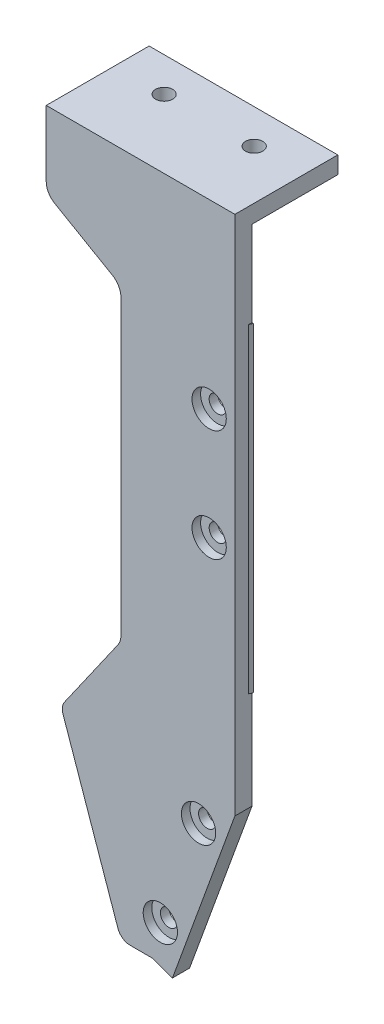
ISO-10303-21;
HEADER;
FILE_DESCRIPTION(('STEP AP214'),'2;1');
FILE_NAME('part.step','',(''),(''),'','','');
FILE_SCHEMA(('AUTOMOTIVE_DESIGN { 1 0 10303 214 1 1 1 1 }'));
ENDSEC;
DATA;
#1=APPLICATION_CONTEXT('core data for automotive mechanical design processes');
#2=APPLICATION_PROTOCOL_DEFINITION('international standard','automotive_design',2000,#1);
#3=PRODUCT_CONTEXT('',#1,'mechanical');
#4=PRODUCT('Part','Part','',(#3));
#5=PRODUCT_RELATED_PRODUCT_CATEGORY('part','',(#4));
#6=PRODUCT_DEFINITION_FORMATION('','',#4);
#7=PRODUCT_DEFINITION_CONTEXT('part definition',#1,'design');
#8=PRODUCT_DEFINITION('design','',#6,#7);
#9=PRODUCT_DEFINITION_SHAPE('','',#8);
#10=(LENGTH_UNIT() NAMED_UNIT(*) SI_UNIT(.MILLI.,.METRE.));
#11=(NAMED_UNIT(*) PLANE_ANGLE_UNIT() SI_UNIT($,.RADIAN.));
#12=(NAMED_UNIT(*) SI_UNIT($,.STERADIAN.) SOLID_ANGLE_UNIT());
#13=UNCERTAINTY_MEASURE_WITH_UNIT(LENGTH_MEASURE(1.E-05),#10,'distance_accuracy_value','');
#14=(GEOMETRIC_REPRESENTATION_CONTEXT(3) GLOBAL_UNCERTAINTY_ASSIGNED_CONTEXT((#13)) GLOBAL_UNIT_ASSIGNED_CONTEXT((#10,
#11,#12)) REPRESENTATION_CONTEXT('',''));
#15=CARTESIAN_POINT('',(0.,0.,0.));
#16=DIRECTION('',(0.,0.,1.));
#17=DIRECTION('',(1.,0.,0.));
#18=AXIS2_PLACEMENT_3D('',#15,#16,#17);
#19=CARTESIAN_POINT('',(91.0567161561715,-93.9915403547906,27.5));
#20=DIRECTION('',(0.,0.,-1.));
#21=DIRECTION('',(-1.,0.,0.));
#22=AXIS2_PLACEMENT_3D('',#19,#20,#21);
#23=CYLINDRICAL_SURFACE('',#22,0.999999999999998);
#24=CARTESIAN_POINT('',(91.0567161561715,-93.9915403547906,21.5));
#25=DIRECTION('',(0.,0.,-1.));
#26=DIRECTION('',(-1.,0.,0.));
#27=AXIS2_PLACEMENT_3D('',#24,#25,#26);
#28=CIRCLE('',#27,0.999999999999998);
#29=CARTESIAN_POINT('',(90.0567161561715,-93.9915403547906,21.5));
#30=VERTEX_POINT('',#29);
#31=EDGE_CURVE('E342',#30,#30,#28,.T.);
#32=ORIENTED_EDGE('',*,*,#31,.T.);
#33=EDGE_LOOP('',(#32));
#34=FACE_BOUND('',#33,.T.);
#35=CARTESIAN_POINT('',(91.0567161561715,-93.9915403547906,22.5));
#36=DIRECTION('',(0.,0.,1.));
#37=DIRECTION('',(1.,0.,0.));
#38=AXIS2_PLACEMENT_3D('',#35,#36,#37);
#39=CIRCLE('',#38,0.999999999999998);
#40=CARTESIAN_POINT('',(92.0567161561715,-93.9915403547906,22.5));
#41=VERTEX_POINT('',#40);
#42=EDGE_CURVE('E42',#41,#41,#39,.F.);
#43=ORIENTED_EDGE('',*,*,#42,.F.);
#44=EDGE_LOOP('',(#43));
#45=FACE_BOUND('',#44,.T.);
#46=ADVANCED_FACE('F38',(#34,#45),#23,.F.);
#47=CARTESIAN_POINT('',(86.6001936886376,-106.235735203631,27.5));
#48=DIRECTION('',(0.,0.,-1.));
#49=DIRECTION('',(-1.,0.,0.));
#50=AXIS2_PLACEMENT_3D('',#47,#48,#49);
#51=CYLINDRICAL_SURFACE('',#50,0.999999999999998);
#52=CARTESIAN_POINT('',(86.6001936886376,-106.235735203631,21.5));
#53=DIRECTION('',(0.,0.,-1.));
#54=DIRECTION('',(-1.,0.,0.));
#55=AXIS2_PLACEMENT_3D('',#52,#53,#54);
#56=CIRCLE('',#55,0.999999999999998);
#57=CARTESIAN_POINT('',(85.6001936886376,-106.235735203631,21.5));
#58=VERTEX_POINT('',#57);
#59=EDGE_CURVE('E367',#58,#58,#56,.T.);
#60=ORIENTED_EDGE('',*,*,#59,.T.);
#61=EDGE_LOOP('',(#60));
#62=FACE_BOUND('',#61,.T.);
#63=CARTESIAN_POINT('',(86.6001936886376,-106.235735203631,22.5));
#64=DIRECTION('',(0.,0.,1.));
#65=DIRECTION('',(1.,0.,0.));
#66=AXIS2_PLACEMENT_3D('',#63,#64,#65);
#67=CIRCLE('',#66,0.999999999999998);
#68=CARTESIAN_POINT('',(87.6001936886376,-106.235735203631,22.5));
#69=VERTEX_POINT('',#68);
#70=EDGE_CURVE('E346',#69,#69,#67,.F.);
#71=ORIENTED_EDGE('',*,*,#70,.F.);
#72=EDGE_LOOP('',(#71));
#73=FACE_BOUND('',#72,.T.);
#74=ADVANCED_FACE('F428',(#62,#73),#51,.F.);
#75=CARTESIAN_POINT('',(92.2895532458189,-64.5135083268963,27.5));
#76=DIRECTION('',(0.,0.,-1.));
#77=DIRECTION('',(-1.,0.,0.));
#78=AXIS2_PLACEMENT_3D('',#75,#76,#77);
#79=CYLINDRICAL_SURFACE('',#78,0.999999999999998);
#80=CARTESIAN_POINT('',(92.2895532458189,-64.5135083268963,21.5));
#81=DIRECTION('',(0.,0.,-1.));
#82=DIRECTION('',(-1.,0.,0.));
#83=AXIS2_PLACEMENT_3D('',#80,#81,#82);
#84=CIRCLE('',#83,0.999999999999998);
#85=CARTESIAN_POINT('',(91.2895532458189,-64.5135083268963,21.5));
#86=VERTEX_POINT('',#85);
#87=EDGE_CURVE('E363',#86,#86,#84,.T.);
#88=ORIENTED_EDGE('',*,*,#87,.T.);
#89=EDGE_LOOP('',(#88));
#90=FACE_BOUND('',#89,.T.);
#91=CARTESIAN_POINT('',(92.2895532458189,-64.5135083268963,22.5));
#92=DIRECTION('',(0.,0.,1.));
#93=DIRECTION('',(1.,0.,0.));
#94=AXIS2_PLACEMENT_3D('',#91,#92,#93);
#95=CIRCLE('',#94,0.999999999999998);
#96=CARTESIAN_POINT('',(93.2895532458189,-64.5135083268963,22.5));
#97=VERTEX_POINT('',#96);
#98=EDGE_CURVE('E344',#97,#97,#95,.F.);
#99=ORIENTED_EDGE('',*,*,#98,.F.);
#100=EDGE_LOOP('',(#99));
#101=FACE_BOUND('',#100,.T.);
#102=ADVANCED_FACE('F434',(#90,#101),#79,.F.);
#103=CARTESIAN_POINT('',(92.2895532458189,-51.5135083268963,27.5));
#104=DIRECTION('',(0.,0.,-1.));
#105=DIRECTION('',(-1.,0.,0.));
#106=AXIS2_PLACEMENT_3D('',#103,#104,#105);
#107=CYLINDRICAL_SURFACE('',#106,0.999999999999998);
#108=CARTESIAN_POINT('',(92.2895532458189,-51.5135083268963,21.5));
#109=DIRECTION('',(0.,0.,-1.));
#110=DIRECTION('',(-1.,0.,0.));
#111=AXIS2_PLACEMENT_3D('',#108,#109,#110);
#112=CIRCLE('',#111,0.999999999999998);
#113=CARTESIAN_POINT('',(91.2895532458189,-51.5135083268963,21.5));
#114=VERTEX_POINT('',#113);
#115=EDGE_CURVE('E366',#114,#114,#112,.T.);
#116=ORIENTED_EDGE('',*,*,#115,.T.);
#117=EDGE_LOOP('',(#116));
#118=FACE_BOUND('',#117,.T.);
#119=CARTESIAN_POINT('',(92.2895532458189,-51.5135083268963,22.5));
#120=DIRECTION('',(0.,0.,1.));
#121=DIRECTION('',(1.,0.,0.));
#122=AXIS2_PLACEMENT_3D('',#119,#120,#121);
#123=CIRCLE('',#122,0.999999999999998);
#124=CARTESIAN_POINT('',(93.2895532458189,-51.5135083268963,22.5));
#125=VERTEX_POINT('',#124);
#126=EDGE_CURVE('E339',#125,#125,#123,.F.);
#127=ORIENTED_EDGE('',*,*,#126,.F.);
#128=EDGE_LOOP('',(#127));
#129=FACE_BOUND('',#128,.T.);
#130=ADVANCED_FACE('F440',(#118,#129),#107,.F.);
#131=CARTESIAN_POINT('',(70.,-110.3,21.5));
#132=DIRECTION('',(0.,0.,1.));
#133=DIRECTION('',(0.,-1.,0.));
#134=AXIS2_PLACEMENT_3D('',#131,#132,#133);
#135=PLANE('',#134);
#136=ORIENTED_EDGE('',*,*,#87,.F.);
#137=EDGE_LOOP('',(#136));
#138=FACE_BOUND('',#137,.T.);
#139=ORIENTED_EDGE('',*,*,#59,.F.);
#140=EDGE_LOOP('',(#139));
#141=FACE_BOUND('',#140,.T.);
#142=ORIENTED_EDGE('',*,*,#31,.F.);
#143=EDGE_LOOP('',(#142));
#144=FACE_BOUND('',#143,.T.);
#145=ORIENTED_EDGE('',*,*,#115,.F.);
#146=EDGE_LOOP('',(#145));
#147=FACE_BOUND('',#146,.T.);
#148=DIRECTION('',(-1.,0.,0.));
#149=VECTOR('',#148,1.);
#150=CARTESIAN_POINT('',(73.2895532458189,-32.3635083268963,21.5));
#151=LINE('',#150,#149);
#152=CARTESIAN_POINT('',(95.2895532458189,-32.3635083268963,21.5));
#153=VERTEX_POINT('',#152);
#154=CARTESIAN_POINT('',(73.2895532458189,-32.3635083268963,21.5));
#155=VERTEX_POINT('',#154);
#156=EDGE_CURVE('E55',#153,#155,#151,.T.);
#157=ORIENTED_EDGE('',*,*,#156,.F.);
#158=DIRECTION('',(0.,1.,0.));
#159=VECTOR('',#158,1.);
#160=CARTESIAN_POINT('',(95.2895532458189,0.,21.5));
#161=LINE('',#160,#159);
#162=CARTESIAN_POINT('',(95.2895532458189,-42.3,21.5));
#163=VERTEX_POINT('',#162);
#164=EDGE_CURVE('E198',#163,#153,#161,.T.);
#165=ORIENTED_EDGE('',*,*,#164,.F.);
#166=DIRECTION('',(1.,0.,0.));
#167=VECTOR('',#166,1.);
#168=CARTESIAN_POINT('',(94.75,-42.3,21.5));
#169=LINE('',#168,#167);
#170=CARTESIAN_POINT('',(95.4364916731037,-42.3,21.5));
#171=VERTEX_POINT('',#170);
#172=EDGE_CURVE('E265',#163,#171,#169,.T.);
#173=ORIENTED_EDGE('',*,*,#172,.T.);
#174=DIRECTION('',(0.,-1.,0.));
#175=VECTOR('',#174,1.);
#176=CARTESIAN_POINT('',(95.4364916731037,-42.3,21.5));
#177=LINE('',#176,#175);
#178=CARTESIAN_POINT('',(95.4364916731037,-79.5997924618132,21.5));
#179=VERTEX_POINT('',#178);
#180=EDGE_CURVE('E267',#171,#179,#177,.T.);
#181=ORIENTED_EDGE('',*,*,#180,.T.);
#182=DIRECTION('',(1.,0.,0.));
#183=VECTOR('',#182,1.);
#184=CARTESIAN_POINT('',(94.38388347648,-79.59979246179,21.5));
#185=LINE('',#184,#183);
#186=CARTESIAN_POINT('',(95.2895532458189,-79.5997924618016,21.5));
#187=VERTEX_POINT('',#186);
#188=EDGE_CURVE('E270',#187,#179,#185,.T.);
#189=ORIENTED_EDGE('',*,*,#188,.F.);
#190=CARTESIAN_POINT('',(95.2895532458189,-91.1333292312439,21.5));
#191=VERTEX_POINT('',#190);
#192=EDGE_CURVE('E211',#191,#187,#161,.T.);
#193=ORIENTED_EDGE('',*,*,#192,.F.);
#194=DIRECTION('',(-0.342020143325699,-0.939692620785897,0.));
#195=VECTOR('',#194,1.);
#196=CARTESIAN_POINT('',(95.2895532458189,-91.1333292312439,21.5));
#197=LINE('',#196,#195);
#198=CARTESIAN_POINT('',(88.0101485604946,-111.133329231243,21.5));
#199=VERTEX_POINT('',#198);
#200=EDGE_CURVE('E262',#191,#199,#197,.T.);
#201=ORIENTED_EDGE('',*,*,#200,.T.);
#202=DIRECTION('',(-0.939692620785897,0.342020143325699,0.));
#203=VECTOR('',#202,1.);
#204=CARTESIAN_POINT('',(86.190441625069,-110.47101007166,21.5));
#205=LINE('',#204,#203);
#206=CARTESIAN_POINT('',(85.720595314676,-110.3,21.5));
#207=VERTEX_POINT('',#206);
#208=EDGE_CURVE('E273',#199,#207,#205,.T.);
#209=ORIENTED_EDGE('',*,*,#208,.T.);
#210=DIRECTION('',(1.,0.,0.));
#211=VECTOR('',#210,1.);
#212=CARTESIAN_POINT('',(83.066681965713,-110.3,21.5));
#213=LINE('',#212,#211);
#214=CARTESIAN_POINT('',(83.066681965713,-110.3,21.5));
#215=VERTEX_POINT('',#214);
#216=EDGE_CURVE('E278',#215,#207,#213,.T.);
#217=ORIENTED_EDGE('',*,*,#216,.F.);
#218=CARTESIAN_POINT('',(83.066681965713,-108.8,21.5));
#219=DIRECTION('',(0.,0.,-1.));
#220=DIRECTION('',(0.,-1.,0.));
#221=AXIS2_PLACEMENT_3D('',#218,#219,#220);
#222=CIRCLE('',#221,1.5);
#223=CARTESIAN_POINT('',(81.6498173079181,-109.29243734778,21.5));
#224=VERTEX_POINT('',#223);
#225=EDGE_CURVE('E277',#215,#224,#222,.T.);
#226=ORIENTED_EDGE('',*,*,#225,.T.);
#227=DIRECTION('',(-0.328291565188003,0.944576438530208,0.));
#228=VECTOR('',#227,1.);
#229=CARTESIAN_POINT('',(81.6498173079181,-109.29243734778,21.5));
#230=LINE('',#229,#228);
#231=CARTESIAN_POINT('',(75.251803773117,-90.88376201398,21.5));
#232=VERTEX_POINT('',#231);
#233=EDGE_CURVE('E283',#224,#232,#230,.T.);
#234=ORIENTED_EDGE('',*,*,#233,.T.);
#235=CARTESIAN_POINT('',(76.668668430912,-90.3913246662,21.5));
#236=DIRECTION('',(0.,0.,-1.));
#237=DIRECTION('',(-0.944576438530206,-0.328291565188007,0.));
#238=AXIS2_PLACEMENT_3D('',#235,#236,#237);
#239=CIRCLE('',#238,1.5);
#240=CARTESIAN_POINT('',(75.439940364479,-89.5309600116699,21.5));
#241=VERTEX_POINT('',#240);
#242=EDGE_CURVE('E286',#232,#241,#239,.T.);
#243=ORIENTED_EDGE('',*,*,#242,.T.);
#244=DIRECTION('',(0.573576436351011,0.819152044289016,0.));
#245=VECTOR('',#244,1.);
#246=CARTESIAN_POINT('',(75.439940364479,-89.5309600116699,21.5));
#247=LINE('',#246,#245);
#248=CARTESIAN_POINT('',(81.638304088578,-80.67877921404,21.5));
#249=VERTEX_POINT('',#248);
#250=EDGE_CURVE('E289',#241,#249,#247,.T.);
#251=ORIENTED_EDGE('',*,*,#250,.T.);
#252=CARTESIAN_POINT('',(80.,-79.5316263413399,21.5));
#253=DIRECTION('',(0.,0.,1.));
#254=DIRECTION('',(0.81915204428897,-0.573576436351077,0.));
#255=AXIS2_PLACEMENT_3D('',#252,#253,#254);
#256=CIRCLE('',#255,2.);
#257=CARTESIAN_POINT('',(82.,-79.5316263413399,21.5));
#258=VERTEX_POINT('',#257);
#259=EDGE_CURVE('E292',#249,#258,#256,.T.);
#260=ORIENTED_EDGE('',*,*,#259,.T.);
#261=DIRECTION('',(0.,1.,0.));
#262=VECTOR('',#261,1.);
#263=CARTESIAN_POINT('',(82.,-79.5316263413399,21.5));
#264=LINE('',#263,#262);
#265=CARTESIAN_POINT('',(82.,-45.38290376865,21.5));
#266=VERTEX_POINT('',#265);
#267=EDGE_CURVE('E295',#258,#266,#264,.T.);
#268=ORIENTED_EDGE('',*,*,#267,.T.);
#269=CARTESIAN_POINT('',(80.,-45.38290376865,21.5));
#270=DIRECTION('',(0.,0.,1.));
#271=DIRECTION('',(1.,0.,0.));
#272=AXIS2_PLACEMENT_3D('',#269,#270,#271);
#273=CIRCLE('',#272,2.);
#274=CARTESIAN_POINT('',(81.,-43.65085296109,21.5));
#275=VERTEX_POINT('',#274);
#276=EDGE_CURVE('E298',#266,#275,#273,.T.);
#277=ORIENTED_EDGE('',*,*,#276,.T.);
#278=DIRECTION('',(-0.866025403784429,0.500000000000017,0.));
#279=VECTOR('',#278,1.);
#280=CARTESIAN_POINT('',(81.,-43.65085296109,21.5));
#281=LINE('',#280,#279);
#282=CARTESIAN_POINT('',(74.2895532458181,-39.7765747211803,21.5));
#283=VERTEX_POINT('',#282);
#284=EDGE_CURVE('E301',#275,#283,#281,.T.);
#285=ORIENTED_EDGE('',*,*,#284,.T.);
#286=CARTESIAN_POINT('',(75.2895532458189,-38.0445239136101,21.5));
#287=DIRECTION('',(0.,0.,1.));
#288=DIRECTION('',(1.,0.,0.));
#289=AXIS2_PLACEMENT_3D('',#286,#287,#288);
#290=CIRCLE('',#289,2.);
#291=CARTESIAN_POINT('',(73.2895532458189,-38.0445239136101,21.5));
#292=VERTEX_POINT('',#291);
#293=EDGE_CURVE('E335',#283,#292,#290,.F.);
#294=ORIENTED_EDGE('',*,*,#293,.T.);
#295=DIRECTION('',(0.,-1.,0.));
#296=VECTOR('',#295,1.);
#297=CARTESIAN_POINT('',(73.2895532458189,0.,21.5));
#298=LINE('',#297,#296);
#299=EDGE_CURVE('E199',#155,#292,#298,.T.);
#300=ORIENTED_EDGE('',*,*,#299,.F.);
#301=EDGE_LOOP('',(#157,#165,#173,#181,#189,#193,#201,#209,#217,#226,#234,#243,#251,#260,#268,
#277,#285,#294,#300));
#302=FACE_BOUND('',#301,.T.);
#303=ADVANCED_FACE('F403',(#138,#141,#144,#147,#302),#135,.F.);
#304=CARTESIAN_POINT('',(93.5,-42.3,21.));
#305=DIRECTION('',(0.,-1.,0.));
#306=DIRECTION('',(-1.,0.,0.));
#307=AXIS2_PLACEMENT_3D('',#304,#305,#306);
#308=CYLINDRICAL_SURFACE('',#307,2.);
#309=CARTESIAN_POINT('',(93.5,-42.3,21.));
#310=DIRECTION('',(0.,-1.,0.));
#311=DIRECTION('',(1.,0.,0.));
#312=AXIS2_PLACEMENT_3D('',#309,#310,#311);
#313=CIRCLE('',#312,2.);
#314=CARTESIAN_POINT('',(95.2895532458189,-42.3,21.8930280960748));
#315=VERTEX_POINT('',#314);
#316=EDGE_CURVE('E325',#171,#315,#313,.T.);
#317=ORIENTED_EDGE('',*,*,#316,.T.);
#318=DIRECTION('',(0.,-1.,0.));
#319=VECTOR('',#318,1.);
#320=CARTESIAN_POINT('',(95.2895532458189,-42.3,21.8930280960748));
#321=LINE('',#320,#319);
#322=CARTESIAN_POINT('',(95.2895532458189,-79.5997924618132,21.8930280960748));
#323=VERTEX_POINT('',#322);
#324=EDGE_CURVE('E257',#315,#323,#321,.T.);
#325=ORIENTED_EDGE('',*,*,#324,.T.);
#326=CARTESIAN_POINT('',(93.5,-79.59979246179,21.));
#327=DIRECTION('',(0.,-1.,0.));
#328=DIRECTION('',(1.,0.,0.));
#329=AXIS2_PLACEMENT_3D('',#326,#327,#328);
#330=CIRCLE('',#329,2.);
#331=EDGE_CURVE('E276',#179,#323,#330,.T.);
#332=ORIENTED_EDGE('',*,*,#331,.F.);
#333=ORIENTED_EDGE('',*,*,#180,.F.);
#334=EDGE_LOOP('',(#317,#325,#332,#333));
#335=FACE_BOUND('',#334,.T.);
#336=ADVANCED_FACE('F410',(#335),#308,.T.);
#337=CARTESIAN_POINT('',(94.38388347648,-79.59979246179,21.88388347648));
#338=DIRECTION('',(0.,1.,0.));
#339=DIRECTION('',(0.,0.,-1.));
#340=AXIS2_PLACEMENT_3D('',#337,#338,#339);
#341=PLANE('',#340);
#342=DIRECTION('',(0.,0.,1.));
#343=VECTOR('',#342,1.);
#344=CARTESIAN_POINT('',(95.2895532458189,-79.59979246179,21.88388347648));
#345=LINE('',#344,#343);
#346=EDGE_CURVE('E260',#187,#323,#345,.T.);
#347=ORIENTED_EDGE('',*,*,#346,.F.);
#348=ORIENTED_EDGE('',*,*,#188,.T.);
#349=ORIENTED_EDGE('',*,*,#331,.T.);
#350=EDGE_LOOP('',(#347,#348,#349));
#351=FACE_BOUND('',#350,.T.);
#352=ADVANCED_FACE('F406',(#351),#341,.F.);
#353=CARTESIAN_POINT('',(94.75,-42.3,18.));
#354=DIRECTION('',(0.,1.,0.));
#355=DIRECTION('',(0.,0.,-1.));
#356=AXIS2_PLACEMENT_3D('',#353,#354,#355);
#357=PLANE('',#356);
#358=ORIENTED_EDGE('',*,*,#172,.F.);
#359=DIRECTION('',(0.,0.,1.));
#360=VECTOR('',#359,1.);
#361=CARTESIAN_POINT('',(95.2895532458189,-42.3,18.));
#362=LINE('',#361,#360);
#363=EDGE_CURVE('E250',#163,#315,#362,.T.);
#364=ORIENTED_EDGE('',*,*,#363,.T.);
#365=ORIENTED_EDGE('',*,*,#316,.F.);
#366=EDGE_LOOP('',(#358,#364,#365));
#367=FACE_BOUND('',#366,.T.);
#368=ADVANCED_FACE('F414',(#367),#357,.T.);
#369=CARTESIAN_POINT('',(76.,-40.76410161514,22.25));
#370=DIRECTION('',(0.500000000000017,0.866025403784429,0.));
#371=DIRECTION('',(0.866025403784429,-0.500000000000017,0.));
#372=AXIS2_PLACEMENT_3D('',#369,#370,#371);
#373=PLANE('',#372);
#374=DIRECTION('',(-0.866025403784429,0.500000000000017,0.));
#375=VECTOR('',#374,1.);
#376=CARTESIAN_POINT('',(1.34862621941938,2.3358891324538,23.5));
#377=LINE('',#376,#375);
#378=CARTESIAN_POINT('',(81.,-43.65085296109,23.5));
#379=VERTEX_POINT('',#378);
#380=CARTESIAN_POINT('',(74.2895532458182,-39.7765747211803,23.5));
#381=VERTEX_POINT('',#380);
#382=EDGE_CURVE('E241',#379,#381,#377,.T.);
#383=ORIENTED_EDGE('',*,*,#382,.T.);
#384=DIRECTION('',(0.,0.,-1.));
#385=VECTOR('',#384,1.);
#386=CARTESIAN_POINT('',(74.2895532458189,-39.776574721179,22.25));
#387=LINE('',#386,#385);
#388=EDGE_CURVE('E332',#381,#283,#387,.T.);
#389=ORIENTED_EDGE('',*,*,#388,.T.);
#390=ORIENTED_EDGE('',*,*,#284,.F.);
#391=DIRECTION('',(0.,0.,-1.));
#392=VECTOR('',#391,1.);
#393=CARTESIAN_POINT('',(81.,-43.65085296109,23.));
#394=LINE('',#393,#392);
#395=EDGE_CURVE('E304',#379,#275,#394,.T.);
#396=ORIENTED_EDGE('',*,*,#395,.F.);
#397=EDGE_LOOP('',(#383,#389,#390,#396));
#398=FACE_BOUND('',#397,.T.);
#399=ADVANCED_FACE('F416',(#398),#373,.F.);
#400=CARTESIAN_POINT('',(80.,-45.38290376865,69.9296));
#401=DIRECTION('',(0.,0.,-1.));
#402=DIRECTION('',(-0.500000000000015,-0.86602540378443,0.));
#403=AXIS2_PLACEMENT_3D('',#400,#401,#402);
#404=CYLINDRICAL_SURFACE('',#403,2.);
#405=ORIENTED_EDGE('',*,*,#276,.F.);
#406=DIRECTION('',(0.,0.,-1.));
#407=VECTOR('',#406,1.);
#408=CARTESIAN_POINT('',(82.,-45.38290376865,23.));
#409=LINE('',#408,#407);
#410=CARTESIAN_POINT('',(82.,-45.38290376865,23.5));
#411=VERTEX_POINT('',#410);
#412=EDGE_CURVE('E307',#411,#266,#409,.T.);
#413=ORIENTED_EDGE('',*,*,#412,.F.);
#414=CARTESIAN_POINT('',(80.,-45.38290376865,23.5));
#415=DIRECTION('',(0.,0.,-1.));
#416=DIRECTION('',(-1.,0.,0.));
#417=AXIS2_PLACEMENT_3D('',#414,#415,#416);
#418=CIRCLE('',#417,2.);
#419=EDGE_CURVE('E238',#411,#379,#418,.F.);
#420=ORIENTED_EDGE('',*,*,#419,.T.);
#421=ORIENTED_EDGE('',*,*,#395,.T.);
#422=EDGE_LOOP('',(#405,#413,#420,#421));
#423=FACE_BOUND('',#422,.T.);
#424=ADVANCED_FACE('F422',(#423),#404,.F.);
#425=CARTESIAN_POINT('',(82.,-62.19521357469,22.25));
#426=DIRECTION('',(1.,0.,0.));
#427=DIRECTION('',(0.,-1.,0.));
#428=AXIS2_PLACEMENT_3D('',#425,#426,#427);
#429=PLANE('',#428);
#430=DIRECTION('',(0.,0.,-1.));
#431=VECTOR('',#430,1.);
#432=CARTESIAN_POINT('',(82.,-79.5316263413399,23.));
#433=LINE('',#432,#431);
#434=CARTESIAN_POINT('',(82.,-79.5316263413399,23.5));
#435=VERTEX_POINT('',#434);
#436=EDGE_CURVE('E310',#435,#258,#433,.T.);
#437=ORIENTED_EDGE('',*,*,#436,.F.);
#438=DIRECTION('',(0.,1.,0.));
#439=VECTOR('',#438,1.);
#440=CARTESIAN_POINT('',(82.,0.,23.5));
#441=LINE('',#440,#439);
#442=EDGE_CURVE('E235',#435,#411,#441,.T.);
#443=ORIENTED_EDGE('',*,*,#442,.T.);
#444=ORIENTED_EDGE('',*,*,#412,.T.);
#445=ORIENTED_EDGE('',*,*,#267,.F.);
#446=EDGE_LOOP('',(#437,#443,#444,#445));
#447=FACE_BOUND('',#446,.T.);
#448=ADVANCED_FACE('F775',(#447),#429,.F.);
#449=CARTESIAN_POINT('',(80.,-79.5316263413399,69.9296));
#450=DIRECTION('',(0.,0.,-1.));
#451=DIRECTION('',(-1.,0.,0.));
#452=AXIS2_PLACEMENT_3D('',#449,#450,#451);
#453=CYLINDRICAL_SURFACE('',#452,2.);
#454=ORIENTED_EDGE('',*,*,#259,.F.);
#455=DIRECTION('',(0.,0.,-1.));
#456=VECTOR('',#455,1.);
#457=CARTESIAN_POINT('',(81.638304088578,-80.67877921404,23.));
#458=LINE('',#457,#456);
#459=CARTESIAN_POINT('',(81.6383040885789,-80.6787792140407,23.5));
#460=VERTEX_POINT('',#459);
#461=EDGE_CURVE('E314',#460,#249,#458,.T.);
#462=ORIENTED_EDGE('',*,*,#461,.F.);
#463=CARTESIAN_POINT('',(80.,-79.5316263413399,23.5));
#464=DIRECTION('',(0.,0.,-1.));
#465=DIRECTION('',(-1.,0.,0.));
#466=AXIS2_PLACEMENT_3D('',#463,#464,#465);
#467=CIRCLE('',#466,2.);
#468=EDGE_CURVE('E232',#460,#435,#467,.F.);
#469=ORIENTED_EDGE('',*,*,#468,.T.);
#470=ORIENTED_EDGE('',*,*,#436,.T.);
#471=EDGE_LOOP('',(#454,#462,#469,#470));
#472=FACE_BOUND('',#471,.T.);
#473=ADVANCED_FACE('F764',(#472),#453,.F.);
#474=CARTESIAN_POINT('',(76.,-88.7311119595499,22.25));
#475=DIRECTION('',(0.819152044289016,-0.573576436351011,0.));
#476=DIRECTION('',(-0.573576436351011,-0.819152044289016,0.));
#477=AXIS2_PLACEMENT_3D('',#474,#475,#476);
#478=PLANE('',#477);
#479=ORIENTED_EDGE('',*,*,#250,.F.);
#480=DIRECTION('',(0.,0.,1.));
#481=VECTOR('',#480,1.);
#482=CARTESIAN_POINT('',(75.439940364479,-89.5309600116699,21.5));
#483=LINE('',#482,#481);
#484=CARTESIAN_POINT('',(75.439940364479,-89.5309600116699,23.5));
#485=VERTEX_POINT('',#484);
#486=EDGE_CURVE('E313',#241,#485,#483,.T.);
#487=ORIENTED_EDGE('',*,*,#486,.T.);
#488=DIRECTION('',(0.573576436351011,0.819152044289016,0.));
#489=VECTOR('',#488,1.);
#490=CARTESIAN_POINT('',(92.6867510176329,-64.8999617547072,23.5));
#491=LINE('',#490,#489);
#492=EDGE_CURVE('E229',#485,#460,#491,.T.);
#493=ORIENTED_EDGE('',*,*,#492,.T.);
#494=ORIENTED_EDGE('',*,*,#461,.T.);
#495=EDGE_LOOP('',(#479,#487,#493,#494));
#496=FACE_BOUND('',#495,.T.);
#497=ADVANCED_FACE('F753',(#496),#478,.F.);
#498=CARTESIAN_POINT('',(76.668668430912,-90.3913246662,-59.9296));
#499=DIRECTION('',(0.,0.,1.));
#500=DIRECTION('',(0.819152044289016,-0.573576436351012,0.));
#501=AXIS2_PLACEMENT_3D('',#498,#499,#500);
#502=CYLINDRICAL_SURFACE('',#501,1.5);
#503=ORIENTED_EDGE('',*,*,#486,.F.);
#504=ORIENTED_EDGE('',*,*,#242,.F.);
#505=DIRECTION('',(0.,0.,1.));
#506=VECTOR('',#505,1.);
#507=CARTESIAN_POINT('',(75.251803773117,-90.88376201398,21.5));
#508=LINE('',#507,#506);
#509=CARTESIAN_POINT('',(75.2518037731161,-90.8837620139803,23.5));
#510=VERTEX_POINT('',#509);
#511=EDGE_CURVE('E317',#232,#510,#508,.T.);
#512=ORIENTED_EDGE('',*,*,#511,.T.);
#513=CARTESIAN_POINT('',(76.668668430912,-90.3913246662,23.5));
#514=DIRECTION('',(0.,0.,-1.));
#515=DIRECTION('',(-1.,0.,0.));
#516=AXIS2_PLACEMENT_3D('',#513,#514,#515);
#517=CIRCLE('',#516,1.5);
#518=EDGE_CURVE('E226',#510,#485,#517,.T.);
#519=ORIENTED_EDGE('',*,*,#518,.T.);
#520=EDGE_LOOP('',(#503,#504,#512,#519));
#521=FACE_BOUND('',#520,.T.);
#522=ADVANCED_FACE('F742',(#521),#502,.T.);
#523=CARTESIAN_POINT('',(78.5,-100.22962998314,22.25));
#524=DIRECTION('',(0.944576438530208,0.328291565188003,0.));
#525=DIRECTION('',(0.328291565188003,-0.944576438530208,0.));
#526=AXIS2_PLACEMENT_3D('',#523,#524,#525);
#527=PLANE('',#526);
#528=ORIENTED_EDGE('',*,*,#233,.F.);
#529=DIRECTION('',(0.,0.,1.));
#530=VECTOR('',#529,1.);
#531=CARTESIAN_POINT('',(81.6498173079181,-109.29243734778,21.5));
#532=LINE('',#531,#530);
#533=CARTESIAN_POINT('',(81.6498173079181,-109.29243734778,23.5));
#534=VERTEX_POINT('',#533);
#535=EDGE_CURVE('E320',#224,#534,#532,.T.);
#536=ORIENTED_EDGE('',*,*,#535,.T.);
#537=DIRECTION('',(-0.328291565188003,0.944576438530208,0.));
#538=VECTOR('',#537,1.);
#539=CARTESIAN_POINT('',(38.9587796924058,13.5402898498463,23.5));
#540=LINE('',#539,#538);
#541=EDGE_CURVE('E223',#534,#510,#540,.T.);
#542=ORIENTED_EDGE('',*,*,#541,.T.);
#543=ORIENTED_EDGE('',*,*,#511,.F.);
#544=EDGE_LOOP('',(#528,#536,#542,#543));
#545=FACE_BOUND('',#544,.T.);
#546=ADVANCED_FACE('F731',(#545),#527,.F.);
#547=CARTESIAN_POINT('',(83.066681965713,-108.8,-59.9296));
#548=DIRECTION('',(0.,0.,1.));
#549=DIRECTION('',(0.944576438530206,0.328291565188007,0.));
#550=AXIS2_PLACEMENT_3D('',#547,#548,#549);
#551=CYLINDRICAL_SURFACE('',#550,1.5);
#552=ORIENTED_EDGE('',*,*,#535,.F.);
#553=ORIENTED_EDGE('',*,*,#225,.F.);
#554=DIRECTION('',(0.,0.,1.));
#555=VECTOR('',#554,1.);
#556=CARTESIAN_POINT('',(83.066681965713,-110.3,21.5));
#557=LINE('',#556,#555);
#558=CARTESIAN_POINT('',(83.066681965713,-110.3,23.5));
#559=VERTEX_POINT('',#558);
#560=EDGE_CURVE('E280',#215,#559,#557,.T.);
#561=ORIENTED_EDGE('',*,*,#560,.T.);
#562=CARTESIAN_POINT('',(83.066681965713,-108.8,23.5));
#563=DIRECTION('',(0.,0.,-1.));
#564=DIRECTION('',(-1.,0.,0.));
#565=AXIS2_PLACEMENT_3D('',#562,#563,#564);
#566=CIRCLE('',#565,1.5);
#567=EDGE_CURVE('E220',#559,#534,#566,.T.);
#568=ORIENTED_EDGE('',*,*,#567,.T.);
#569=EDGE_LOOP('',(#552,#553,#561,#568));
#570=FACE_BOUND('',#569,.T.);
#571=ADVANCED_FACE('F720',(#570),#551,.T.);
#572=CARTESIAN_POINT('',(81.5,-110.3,22.25));
#573=DIRECTION('',(0.,-1.,0.));
#574=DIRECTION('',(-1.,0.,0.));
#575=AXIS2_PLACEMENT_3D('',#572,#573,#574);
#576=PLANE('',#575);
#577=ORIENTED_EDGE('',*,*,#216,.T.);
#578=DIRECTION('',(0.,0.,-1.));
#579=VECTOR('',#578,1.);
#580=CARTESIAN_POINT('',(85.720595314676,-110.3,23.));
#581=LINE('',#580,#579);
#582=CARTESIAN_POINT('',(85.720595314676,-110.3,23.5));
#583=VERTEX_POINT('',#582);
#584=EDGE_CURVE('E272',#583,#207,#581,.T.);
#585=ORIENTED_EDGE('',*,*,#584,.F.);
#586=DIRECTION('',(-1.,0.,0.));
#587=VECTOR('',#586,1.);
#588=CARTESIAN_POINT('',(-1.77186336060973E-12,-110.299999999999,23.5));
#589=LINE('',#588,#587);
#590=EDGE_CURVE('E217',#583,#559,#589,.T.);
#591=ORIENTED_EDGE('',*,*,#590,.T.);
#592=ORIENTED_EDGE('',*,*,#560,.F.);
#593=EDGE_LOOP('',(#577,#585,#591,#592));
#594=FACE_BOUND('',#593,.T.);
#595=ADVANCED_FACE('F710',(#594),#576,.T.);
#596=CARTESIAN_POINT('',(86.190441625069,-110.47101007166,22.25));
#597=DIRECTION('',(-0.342020143325699,-0.939692620785897,0.));
#598=DIRECTION('',(-0.939692620785897,0.342020143325699,0.));
#599=AXIS2_PLACEMENT_3D('',#596,#597,#598);
#600=PLANE('',#599);
#601=ORIENTED_EDGE('',*,*,#208,.F.);
#602=DIRECTION('',(0.,0.,-1.));
#603=VECTOR('',#602,1.);
#604=CARTESIAN_POINT('',(88.0101485604946,-111.133329231243,23.5));
#605=LINE('',#604,#603);
#606=CARTESIAN_POINT('',(88.0101485604946,-111.133329231243,23.5));
#607=VERTEX_POINT('',#606);
#608=EDGE_CURVE('E251',#607,#199,#605,.T.);
#609=ORIENTED_EDGE('',*,*,#608,.F.);
#610=DIRECTION('',(-0.939692620785897,0.342020143325699,0.));
#611=VECTOR('',#610,1.);
#612=CARTESIAN_POINT('',(-25.4223318677038,-69.8472827563908,23.5));
#613=LINE('',#612,#611);
#614=EDGE_CURVE('E214',#607,#583,#613,.T.);
#615=ORIENTED_EDGE('',*,*,#614,.T.);
#616=ORIENTED_EDGE('',*,*,#584,.T.);
#617=EDGE_LOOP('',(#601,#609,#615,#616));
#618=FACE_BOUND('',#617,.T.);
#619=ADVANCED_FACE('F470',(#618),#600,.T.);
#620=CARTESIAN_POINT('',(95.2895532458189,0.,23.5));
#621=DIRECTION('',(-1.,0.,0.));
#622=DIRECTION('',(0.,0.,1.));
#623=AXIS2_PLACEMENT_3D('',#620,#621,#622);
#624=PLANE('',#623);
#625=ORIENTED_EDGE('',*,*,#192,.T.);
#626=ORIENTED_EDGE('',*,*,#346,.T.);
#627=ORIENTED_EDGE('',*,*,#324,.F.);
#628=ORIENTED_EDGE('',*,*,#363,.F.);
#629=ORIENTED_EDGE('',*,*,#164,.T.);
#630=DIRECTION('',(0.,0.,1.));
#631=VECTOR('',#630,1.);
#632=CARTESIAN_POINT('',(95.2895532458189,-32.3635083268963,11.5));
#633=LINE('',#632,#631);
#634=CARTESIAN_POINT('',(95.2895532458189,-32.3635083268963,11.5));
#635=VERTEX_POINT('',#634);
#636=EDGE_CURVE('E180',#635,#153,#633,.T.);
#637=ORIENTED_EDGE('',*,*,#636,.F.);
#638=DIRECTION('',(0.,-1.,0.));
#639=VECTOR('',#638,1.);
#640=CARTESIAN_POINT('',(95.2895532458189,-32.3635083268963,11.5));
#641=LINE('',#640,#639);
#642=CARTESIAN_POINT('',(95.2895532458189,-30.3635083268963,11.5));
#643=VERTEX_POINT('',#642);
#644=EDGE_CURVE('E187',#643,#635,#641,.T.);
#645=ORIENTED_EDGE('',*,*,#644,.F.);
#646=DIRECTION('',(0.,0.,-1.));
#647=VECTOR('',#646,1.);
#648=CARTESIAN_POINT('',(95.2895532458189,-30.3635083268963,23.5));
#649=LINE('',#648,#647);
#650=CARTESIAN_POINT('',(95.2895532458189,-30.3635083268963,23.5));
#651=VERTEX_POINT('',#650);
#652=EDGE_CURVE('E248',#651,#643,#649,.T.);
#653=ORIENTED_EDGE('',*,*,#652,.F.);
#654=DIRECTION('',(0.,1.,0.));
#655=VECTOR('',#654,1.);
#656=CARTESIAN_POINT('',(95.2895532458189,0.,23.5));
#657=LINE('',#656,#655);
#658=CARTESIAN_POINT('',(95.2895532458189,-91.1333292312439,23.5));
#659=VERTEX_POINT('',#658);
#660=EDGE_CURVE('E207',#659,#651,#657,.T.);
#661=ORIENTED_EDGE('',*,*,#660,.F.);
#662=DIRECTION('',(0.,0.,-1.));
#663=VECTOR('',#662,1.);
#664=CARTESIAN_POINT('',(95.2895532458189,-91.1333292312439,23.5));
#665=LINE('',#664,#663);
#666=EDGE_CURVE('E246',#659,#191,#665,.T.);
#667=ORIENTED_EDGE('',*,*,#666,.T.);
#668=EDGE_LOOP('',(#625,#626,#627,#628,#629,#637,#645,#653,#661,#667));
#669=FACE_BOUND('',#668,.T.);
#670=ADVANCED_FACE('F197',(#669),#624,.F.);
#671=CARTESIAN_POINT('',(0.,-30.3635083268963,23.5));
#672=DIRECTION('',(0.,1.,0.));
#673=DIRECTION('',(0.,0.,1.));
#674=AXIS2_PLACEMENT_3D('',#671,#672,#673);
#675=PLANE('',#674);
#676=CARTESIAN_POINT('',(89.5395532458189,-30.3635083268963,15.5));
#677=DIRECTION('',(0.,1.,0.));
#678=DIRECTION('',(0.,0.,1.));
#679=AXIS2_PLACEMENT_3D('',#676,#677,#678);
#680=CIRCLE('',#679,0.999999999999998);
#681=CARTESIAN_POINT('',(89.5395532458189,-30.3635083268963,16.5));
#682=VERTEX_POINT('',#681);
#683=EDGE_CURVE('E377',#682,#682,#680,.T.);
#684=ORIENTED_EDGE('',*,*,#683,.F.);
#685=EDGE_LOOP('',(#684));
#686=FACE_BOUND('',#685,.T.);
#687=CARTESIAN_POINT('',(79.0395532458189,-30.3635083268963,15.5));
#688=DIRECTION('',(0.,1.,0.));
#689=DIRECTION('',(0.,0.,1.));
#690=AXIS2_PLACEMENT_3D('',#687,#688,#689);
#691=CIRCLE('',#690,0.999999999999998);
#692=CARTESIAN_POINT('',(79.0395532458189,-30.3635083268963,16.5));
#693=VERTEX_POINT('',#692);
#694=EDGE_CURVE('E383',#693,#693,#691,.T.);
#695=ORIENTED_EDGE('',*,*,#694,.F.);
#696=EDGE_LOOP('',(#695));
#697=FACE_BOUND('',#696,.T.);
#698=DIRECTION('',(0.,0.,-1.));
#699=VECTOR('',#698,1.);
#700=CARTESIAN_POINT('',(73.2895532458189,-30.3635083268963,31.5));
#701=LINE('',#700,#699);
#702=CARTESIAN_POINT('',(73.2895532458189,-30.3635083268963,23.5));
#703=VERTEX_POINT('',#702);
#704=CARTESIAN_POINT('',(73.2895532458189,-30.3635083268963,11.5));
#705=VERTEX_POINT('',#704);
#706=EDGE_CURVE('E201',#703,#705,#701,.T.);
#707=ORIENTED_EDGE('',*,*,#706,.F.);
#708=DIRECTION('',(1.,0.,0.));
#709=VECTOR('',#708,1.);
#710=CARTESIAN_POINT('',(0.,-30.3635083268963,23.5));
#711=LINE('',#710,#709);
#712=EDGE_CURVE('E244',#703,#651,#711,.T.);
#713=ORIENTED_EDGE('',*,*,#712,.T.);
#714=ORIENTED_EDGE('',*,*,#652,.T.);
#715=DIRECTION('',(1.,0.,0.));
#716=VECTOR('',#715,1.);
#717=CARTESIAN_POINT('',(95.2895532458189,-30.3635083268963,11.5));
#718=LINE('',#717,#716);
#719=EDGE_CURVE('E193',#705,#643,#718,.T.);
#720=ORIENTED_EDGE('',*,*,#719,.F.);
#721=EDGE_LOOP('',(#707,#713,#714,#720));
#722=FACE_BOUND('',#721,.T.);
#723=ADVANCED_FACE('F390',(#686,#697,#722),#675,.T.);
#724=CARTESIAN_POINT('',(113.432480428198,-41.2860464748519,23.5));
#725=DIRECTION('',(0.939692620785897,-0.342020143325699,0.));
#726=DIRECTION('',(0.342020143325699,0.939692620785897,0.));
#727=AXIS2_PLACEMENT_3D('',#724,#725,#726);
#728=PLANE('',#727);
#729=ORIENTED_EDGE('',*,*,#200,.F.);
#730=ORIENTED_EDGE('',*,*,#666,.F.);
#731=DIRECTION('',(-0.342020143325699,-0.939692620785897,0.));
#732=VECTOR('',#731,1.);
#733=CARTESIAN_POINT('',(113.432480428198,-41.2860464748519,23.5));
#734=LINE('',#733,#732);
#735=EDGE_CURVE('E210',#659,#607,#734,.T.);
#736=ORIENTED_EDGE('',*,*,#735,.T.);
#737=ORIENTED_EDGE('',*,*,#608,.T.);
#738=EDGE_LOOP('',(#729,#730,#736,#737));
#739=FACE_BOUND('',#738,.T.);
#740=ADVANCED_FACE('F399',(#739),#728,.T.);
#741=CARTESIAN_POINT('',(0.,0.,23.5));
#742=DIRECTION('',(0.,0.,-1.));
#743=DIRECTION('',(-1.,0.,0.));
#744=AXIS2_PLACEMENT_3D('',#741,#742,#743);
#745=PLANE('',#744);
#746=CARTESIAN_POINT('',(92.2895532458189,-64.5135083268963,23.5));
#747=DIRECTION('',(0.,0.,1.));
#748=DIRECTION('',(1.,0.,0.));
#749=AXIS2_PLACEMENT_3D('',#746,#747,#748);
#750=CIRCLE('',#749,2.);
#751=CARTESIAN_POINT('',(94.2895532458189,-64.5135083268963,23.5));
#752=VERTEX_POINT('',#751);
#753=EDGE_CURVE('E544',#752,#752,#750,.T.);
#754=ORIENTED_EDGE('',*,*,#753,.F.);
#755=EDGE_LOOP('',(#754));
#756=FACE_BOUND('',#755,.T.);
#757=CARTESIAN_POINT('',(91.0567161561715,-93.9915403547906,23.5));
#758=DIRECTION('',(0.,0.,1.));
#759=DIRECTION('',(1.,0.,0.));
#760=AXIS2_PLACEMENT_3D('',#757,#758,#759);
#761=CIRCLE('',#760,2.);
#762=CARTESIAN_POINT('',(93.0567161561715,-93.9915403547906,23.5));
#763=VERTEX_POINT('',#762);
#764=EDGE_CURVE('E534',#763,#763,#761,.T.);
#765=ORIENTED_EDGE('',*,*,#764,.F.);
#766=EDGE_LOOP('',(#765));
#767=FACE_BOUND('',#766,.T.);
#768=CARTESIAN_POINT('',(86.6001936886376,-106.235735203631,23.5));
#769=DIRECTION('',(0.,0.,1.));
#770=DIRECTION('',(1.,0.,0.));
#771=AXIS2_PLACEMENT_3D('',#768,#769,#770);
#772=CIRCLE('',#771,2.);
#773=CARTESIAN_POINT('',(88.6001936886376,-106.235735203631,23.5));
#774=VERTEX_POINT('',#773);
#775=EDGE_CURVE('E535',#774,#774,#772,.T.);
#776=ORIENTED_EDGE('',*,*,#775,.F.);
#777=EDGE_LOOP('',(#776));
#778=FACE_BOUND('',#777,.T.);
#779=CARTESIAN_POINT('',(92.2895532458189,-51.5135083268963,23.5));
#780=DIRECTION('',(0.,0.,1.));
#781=DIRECTION('',(1.,0.,0.));
#782=AXIS2_PLACEMENT_3D('',#779,#780,#781);
#783=CIRCLE('',#782,2.);
#784=CARTESIAN_POINT('',(94.2895532458189,-51.5135083268963,23.5));
#785=VERTEX_POINT('',#784);
#786=EDGE_CURVE('E352',#785,#785,#783,.T.);
#787=ORIENTED_EDGE('',*,*,#786,.F.);
#788=EDGE_LOOP('',(#787));
#789=FACE_BOUND('',#788,.T.);
#790=DIRECTION('',(0.,-1.,0.));
#791=VECTOR('',#790,1.);
#792=CARTESIAN_POINT('',(73.2895532458189,0.,23.5));
#793=LINE('',#792,#791);
#794=CARTESIAN_POINT('',(73.2895532458189,-38.0445239136101,23.5));
#795=VERTEX_POINT('',#794);
#796=EDGE_CURVE('E328',#703,#795,#793,.T.);
#797=ORIENTED_EDGE('',*,*,#796,.T.);
#798=CARTESIAN_POINT('',(75.2895532458189,-38.0445239136101,23.5));
#799=DIRECTION('',(0.,0.,-1.));
#800=DIRECTION('',(-1.,0.,0.));
#801=AXIS2_PLACEMENT_3D('',#798,#799,#800);
#802=CIRCLE('',#801,2.);
#803=EDGE_CURVE('E11',#795,#381,#802,.F.);
#804=ORIENTED_EDGE('',*,*,#803,.T.);
#805=ORIENTED_EDGE('',*,*,#382,.F.);
#806=ORIENTED_EDGE('',*,*,#419,.F.);
#807=ORIENTED_EDGE('',*,*,#442,.F.);
#808=ORIENTED_EDGE('',*,*,#468,.F.);
#809=ORIENTED_EDGE('',*,*,#492,.F.);
#810=ORIENTED_EDGE('',*,*,#518,.F.);
#811=ORIENTED_EDGE('',*,*,#541,.F.);
#812=ORIENTED_EDGE('',*,*,#567,.F.);
#813=ORIENTED_EDGE('',*,*,#590,.F.);
#814=ORIENTED_EDGE('',*,*,#614,.F.);
#815=ORIENTED_EDGE('',*,*,#735,.F.);
#816=ORIENTED_EDGE('',*,*,#660,.T.);
#817=ORIENTED_EDGE('',*,*,#712,.F.);
#818=EDGE_LOOP('',(#797,#804,#805,#806,#807,#808,#809,#810,#811,#812,#813,#814,#815,#816,#817));
#819=FACE_BOUND('',#818,.T.);
#820=ADVANCED_FACE('F396',(#756,#767,#778,#789,#819),#745,.F.);
#821=CARTESIAN_POINT('',(73.2895532458189,0.,31.5));
#822=DIRECTION('',(1.,0.,0.));
#823=DIRECTION('',(0.,0.,-1.));
#824=AXIS2_PLACEMENT_3D('',#821,#822,#823);
#825=PLANE('',#824);
#826=ORIENTED_EDGE('',*,*,#706,.T.);
#827=DIRECTION('',(0.,1.,0.));
#828=VECTOR('',#827,1.);
#829=CARTESIAN_POINT('',(73.2895532458189,-30.3635083268963,11.5));
#830=LINE('',#829,#828);
#831=CARTESIAN_POINT('',(73.2895532458189,-32.3635083268963,11.5));
#832=VERTEX_POINT('',#831);
#833=EDGE_CURVE('E186',#832,#705,#830,.T.);
#834=ORIENTED_EDGE('',*,*,#833,.F.);
#835=DIRECTION('',(0.,0.,1.));
#836=VECTOR('',#835,1.);
#837=CARTESIAN_POINT('',(73.2895532458189,-32.3635083268963,11.5));
#838=LINE('',#837,#836);
#839=EDGE_CURVE('E182',#832,#155,#838,.T.);
#840=ORIENTED_EDGE('',*,*,#839,.T.);
#841=ORIENTED_EDGE('',*,*,#299,.T.);
#842=DIRECTION('',(0.,0.,-1.));
#843=VECTOR('',#842,1.);
#844=CARTESIAN_POINT('',(73.2895532458189,-38.0445239136101,31.5));
#845=LINE('',#844,#843);
#846=EDGE_CURVE('E47',#292,#795,#845,.F.);
#847=ORIENTED_EDGE('',*,*,#846,.T.);
#848=ORIENTED_EDGE('',*,*,#796,.F.);
#849=EDGE_LOOP('',(#826,#834,#840,#841,#847,#848));
#850=FACE_BOUND('',#849,.T.);
#851=ADVANCED_FACE('F387',(#850),#825,.F.);
#852=CARTESIAN_POINT('',(75.2895532458189,-38.0445239136101,22.25));
#853=DIRECTION('',(0.,0.,-1.));
#854=DIRECTION('',(-1.,0.,0.));
#855=AXIS2_PLACEMENT_3D('',#852,#853,#854);
#856=CYLINDRICAL_SURFACE('',#855,2.);
#857=ORIENTED_EDGE('',*,*,#803,.F.);
#858=ORIENTED_EDGE('',*,*,#846,.F.);
#859=ORIENTED_EDGE('',*,*,#293,.F.);
#860=ORIENTED_EDGE('',*,*,#388,.F.);
#861=EDGE_LOOP('',(#857,#858,#859,#860));
#862=FACE_BOUND('',#861,.T.);
#863=ADVANCED_FACE('F40',(#862),#856,.T.);
#864=CARTESIAN_POINT('',(73.2895532458189,-32.3635083268963,11.5));
#865=DIRECTION('',(0.,1.,0.));
#866=DIRECTION('',(0.,0.,1.));
#867=AXIS2_PLACEMENT_3D('',#864,#865,#866);
#868=PLANE('',#867);
#869=CARTESIAN_POINT('',(89.5395532458189,-32.3635083268963,15.5));
#870=DIRECTION('',(0.,-1.,0.));
#871=DIRECTION('',(0.,0.,-1.));
#872=AXIS2_PLACEMENT_3D('',#869,#870,#871);
#873=CIRCLE('',#872,0.999999999999998);
#874=CARTESIAN_POINT('',(89.5395532458189,-32.3635083268963,14.5));
#875=VERTEX_POINT('',#874);
#876=EDGE_CURVE('E374',#875,#875,#873,.T.);
#877=ORIENTED_EDGE('',*,*,#876,.F.);
#878=EDGE_LOOP('',(#877));
#879=FACE_BOUND('',#878,.T.);
#880=CARTESIAN_POINT('',(79.0395532458189,-32.3635083268963,15.5));
#881=DIRECTION('',(0.,-1.,0.));
#882=DIRECTION('',(0.,0.,-1.));
#883=AXIS2_PLACEMENT_3D('',#880,#881,#882);
#884=CIRCLE('',#883,0.999999999999998);
#885=CARTESIAN_POINT('',(79.0395532458189,-32.3635083268963,14.5));
#886=VERTEX_POINT('',#885);
#887=EDGE_CURVE('E380',#886,#886,#884,.T.);
#888=ORIENTED_EDGE('',*,*,#887,.F.);
#889=EDGE_LOOP('',(#888));
#890=FACE_BOUND('',#889,.T.);
#891=ORIENTED_EDGE('',*,*,#156,.T.);
#892=ORIENTED_EDGE('',*,*,#839,.F.);
#893=DIRECTION('',(-1.,0.,0.));
#894=VECTOR('',#893,1.);
#895=CARTESIAN_POINT('',(73.2895532458189,-32.3635083268963,11.5));
#896=LINE('',#895,#894);
#897=EDGE_CURVE('E176',#635,#832,#896,.T.);
#898=ORIENTED_EDGE('',*,*,#897,.F.);
#899=ORIENTED_EDGE('',*,*,#636,.T.);
#900=EDGE_LOOP('',(#891,#892,#898,#899));
#901=FACE_BOUND('',#900,.T.);
#902=ADVANCED_FACE('F178',(#879,#890,#901),#868,.F.);
#903=CARTESIAN_POINT('',(0.,0.,11.5));
#904=DIRECTION('',(0.,0.,1.));
#905=DIRECTION('',(1.,0.,0.));
#906=AXIS2_PLACEMENT_3D('',#903,#904,#905);
#907=PLANE('',#906);
#908=ORIENTED_EDGE('',*,*,#644,.T.);
#909=ORIENTED_EDGE('',*,*,#897,.T.);
#910=ORIENTED_EDGE('',*,*,#833,.T.);
#911=ORIENTED_EDGE('',*,*,#719,.T.);
#912=EDGE_LOOP('',(#908,#909,#910,#911));
#913=FACE_BOUND('',#912,.T.);
#914=ADVANCED_FACE('F191',(#913),#907,.F.);
#915=CARTESIAN_POINT('',(79.0395532458189,-27.1135083268963,15.5));
#916=DIRECTION('',(0.,-1.,0.));
#917=DIRECTION('',(0.,0.,-1.));
#918=AXIS2_PLACEMENT_3D('',#915,#916,#917);
#919=CYLINDRICAL_SURFACE('',#918,0.999999999999998);
#920=ORIENTED_EDGE('',*,*,#694,.T.);
#921=EDGE_LOOP('',(#920));
#922=FACE_BOUND('',#921,.T.);
#923=ORIENTED_EDGE('',*,*,#887,.T.);
#924=EDGE_LOOP('',(#923));
#925=FACE_BOUND('',#924,.T.);
#926=ADVANCED_FACE('F448',(#922,#925),#919,.F.);
#927=CARTESIAN_POINT('',(89.5395532458189,-27.1135083268963,15.5));
#928=DIRECTION('',(0.,-1.,0.));
#929=DIRECTION('',(0.,0.,-1.));
#930=AXIS2_PLACEMENT_3D('',#927,#928,#929);
#931=CYLINDRICAL_SURFACE('',#930,0.999999999999998);
#932=ORIENTED_EDGE('',*,*,#683,.T.);
#933=EDGE_LOOP('',(#932));
#934=FACE_BOUND('',#933,.T.);
#935=ORIENTED_EDGE('',*,*,#876,.T.);
#936=EDGE_LOOP('',(#935));
#937=FACE_BOUND('',#936,.T.);
#938=ADVANCED_FACE('F444',(#934,#937),#931,.F.);
#939=CARTESIAN_POINT('',(92.2895532458189,-51.5135083268963,22.5));
#940=DIRECTION('',(0.,0.,1.));
#941=DIRECTION('',(1.,0.,0.));
#942=AXIS2_PLACEMENT_3D('',#939,#940,#941);
#943=PLANE('',#942);
#944=CARTESIAN_POINT('',(92.2895532458189,-51.5135083268963,22.5));
#945=DIRECTION('',(0.,0.,1.));
#946=DIRECTION('',(1.,0.,0.));
#947=AXIS2_PLACEMENT_3D('',#944,#945,#946);
#948=CIRCLE('',#947,2.);
#949=CARTESIAN_POINT('',(94.2895532458189,-51.5135083268963,22.5));
#950=VERTEX_POINT('',#949);
#951=EDGE_CURVE('E343',#950,#950,#948,.T.);
#952=ORIENTED_EDGE('',*,*,#951,.T.);
#953=EDGE_LOOP('',(#952));
#954=FACE_BOUND('',#953,.T.);
#955=ORIENTED_EDGE('',*,*,#126,.T.);
#956=EDGE_LOOP('',(#955));
#957=FACE_BOUND('',#956,.T.);
#958=ADVANCED_FACE('F447',(#954,#957),#943,.T.);
#959=CARTESIAN_POINT('',(92.2895532458189,-51.5135083268963,22.5));
#960=DIRECTION('',(0.,0.,1.));
#961=DIRECTION('',(1.,0.,0.));
#962=AXIS2_PLACEMENT_3D('',#959,#960,#961);
#963=CYLINDRICAL_SURFACE('',#962,2.);
#964=ORIENTED_EDGE('',*,*,#951,.F.);
#965=EDGE_LOOP('',(#964));
#966=FACE_BOUND('',#965,.T.);
#967=ORIENTED_EDGE('',*,*,#786,.T.);
#968=EDGE_LOOP('',(#967));
#969=FACE_BOUND('',#968,.T.);
#970=ADVANCED_FACE('F487',(#966,#969),#963,.F.);
#971=CARTESIAN_POINT('',(92.2895532458189,-64.5135083268963,22.5));
#972=DIRECTION('',(0.,0.,1.));
#973=DIRECTION('',(1.,0.,0.));
#974=AXIS2_PLACEMENT_3D('',#971,#972,#973);
#975=PLANE('',#974);
#976=CARTESIAN_POINT('',(92.2895532458189,-64.5135083268963,22.5));
#977=DIRECTION('',(0.,0.,1.));
#978=DIRECTION('',(1.,0.,0.));
#979=AXIS2_PLACEMENT_3D('',#976,#977,#978);
#980=CIRCLE('',#979,2.);
#981=CARTESIAN_POINT('',(94.2895532458189,-64.5135083268963,22.5));
#982=VERTEX_POINT('',#981);
#983=EDGE_CURVE('E347',#982,#982,#980,.T.);
#984=ORIENTED_EDGE('',*,*,#983,.T.);
#985=EDGE_LOOP('',(#984));
#986=FACE_BOUND('',#985,.T.);
#987=ORIENTED_EDGE('',*,*,#98,.T.);
#988=EDGE_LOOP('',(#987));
#989=FACE_BOUND('',#988,.T.);
#990=ADVANCED_FACE('F493',(#986,#989),#975,.T.);
#991=CARTESIAN_POINT('',(92.2895532458189,-64.5135083268963,22.5));
#992=DIRECTION('',(0.,0.,1.));
#993=DIRECTION('',(1.,0.,0.));
#994=AXIS2_PLACEMENT_3D('',#991,#992,#993);
#995=CYLINDRICAL_SURFACE('',#994,2.);
#996=ORIENTED_EDGE('',*,*,#983,.F.);
#997=EDGE_LOOP('',(#996));
#998=FACE_BOUND('',#997,.T.);
#999=ORIENTED_EDGE('',*,*,#753,.T.);
#1000=EDGE_LOOP('',(#999));
#1001=FACE_BOUND('',#1000,.T.);
#1002=ADVANCED_FACE('F507',(#998,#1001),#995,.F.);
#1003=CARTESIAN_POINT('',(86.6001936886376,-106.235735203631,22.5));
#1004=DIRECTION('',(0.,0.,1.));
#1005=DIRECTION('',(1.,0.,0.));
#1006=AXIS2_PLACEMENT_3D('',#1003,#1004,#1005);
#1007=PLANE('',#1006);
#1008=CARTESIAN_POINT('',(86.6001936886376,-106.235735203631,22.5));
#1009=DIRECTION('',(0.,0.,1.));
#1010=DIRECTION('',(1.,0.,0.));
#1011=AXIS2_PLACEMENT_3D('',#1008,#1009,#1010);
#1012=CIRCLE('',#1011,2.);
#1013=CARTESIAN_POINT('',(88.6001936886376,-106.235735203631,22.5));
#1014=VERTEX_POINT('',#1013);
#1015=EDGE_CURVE('E533',#1014,#1014,#1012,.T.);
#1016=ORIENTED_EDGE('',*,*,#1015,.T.);
#1017=EDGE_LOOP('',(#1016));
#1018=FACE_BOUND('',#1017,.T.);
#1019=ORIENTED_EDGE('',*,*,#70,.T.);
#1020=EDGE_LOOP('',(#1019));
#1021=FACE_BOUND('',#1020,.T.);
#1022=ADVANCED_FACE('F513',(#1018,#1021),#1007,.T.);
#1023=CARTESIAN_POINT('',(86.6001936886376,-106.235735203631,22.5));
#1024=DIRECTION('',(0.,0.,1.));
#1025=DIRECTION('',(1.,0.,0.));
#1026=AXIS2_PLACEMENT_3D('',#1023,#1024,#1025);
#1027=CYLINDRICAL_SURFACE('',#1026,2.);
#1028=ORIENTED_EDGE('',*,*,#1015,.F.);
#1029=EDGE_LOOP('',(#1028));
#1030=FACE_BOUND('',#1029,.T.);
#1031=ORIENTED_EDGE('',*,*,#775,.T.);
#1032=EDGE_LOOP('',(#1031));
#1033=FACE_BOUND('',#1032,.T.);
#1034=ADVANCED_FACE('F497',(#1030,#1033),#1027,.F.);
#1035=CARTESIAN_POINT('',(91.0567161561715,-93.9915403547906,22.5));
#1036=DIRECTION('',(0.,0.,1.));
#1037=DIRECTION('',(1.,0.,0.));
#1038=AXIS2_PLACEMENT_3D('',#1035,#1036,#1037);
#1039=PLANE('',#1038);
#1040=CARTESIAN_POINT('',(91.0567161561715,-93.9915403547906,22.5));
#1041=DIRECTION('',(0.,0.,1.));
#1042=DIRECTION('',(1.,0.,0.));
#1043=AXIS2_PLACEMENT_3D('',#1040,#1041,#1042);
#1044=CIRCLE('',#1043,2.);
#1045=CARTESIAN_POINT('',(93.0567161561715,-93.9915403547906,22.5));
#1046=VERTEX_POINT('',#1045);
#1047=EDGE_CURVE('E538',#1046,#1046,#1044,.T.);
#1048=ORIENTED_EDGE('',*,*,#1047,.T.);
#1049=EDGE_LOOP('',(#1048));
#1050=FACE_BOUND('',#1049,.T.);
#1051=ORIENTED_EDGE('',*,*,#42,.T.);
#1052=EDGE_LOOP('',(#1051));
#1053=FACE_BOUND('',#1052,.T.);
#1054=ADVANCED_FACE('F518',(#1050,#1053),#1039,.T.);
#1055=CARTESIAN_POINT('',(91.0567161561715,-93.9915403547906,22.5));
#1056=DIRECTION('',(0.,0.,1.));
#1057=DIRECTION('',(1.,0.,0.));
#1058=AXIS2_PLACEMENT_3D('',#1055,#1056,#1057);
#1059=CYLINDRICAL_SURFACE('',#1058,2.);
#1060=ORIENTED_EDGE('',*,*,#1047,.F.);
#1061=EDGE_LOOP('',(#1060));
#1062=FACE_BOUND('',#1061,.T.);
#1063=ORIENTED_EDGE('',*,*,#764,.T.);
#1064=EDGE_LOOP('',(#1063));
#1065=FACE_BOUND('',#1064,.T.);
#1066=ADVANCED_FACE('F521',(#1062,#1065),#1059,.F.);
#1067=CLOSED_SHELL('',(#46,#74,#102,#130,#303,#336,#352,#368,#399,#424,#448,#473,#497,#522,#546,
#571,#595,#619,#670,#723,#740,#820,#851,#863,#902,#914,#926,#938,#958,#970,#990,#1002,#1022,
#1034,#1054,#1066));
#1068=MANIFOLD_SOLID_BREP('B2',#1067);
#1069=ADVANCED_BREP_SHAPE_REPRESENTATION('',(#18,#1068),#14);
#1070=SHAPE_DEFINITION_REPRESENTATION(#9,#1069);
ENDSEC;
END-ISO-10303-21;
